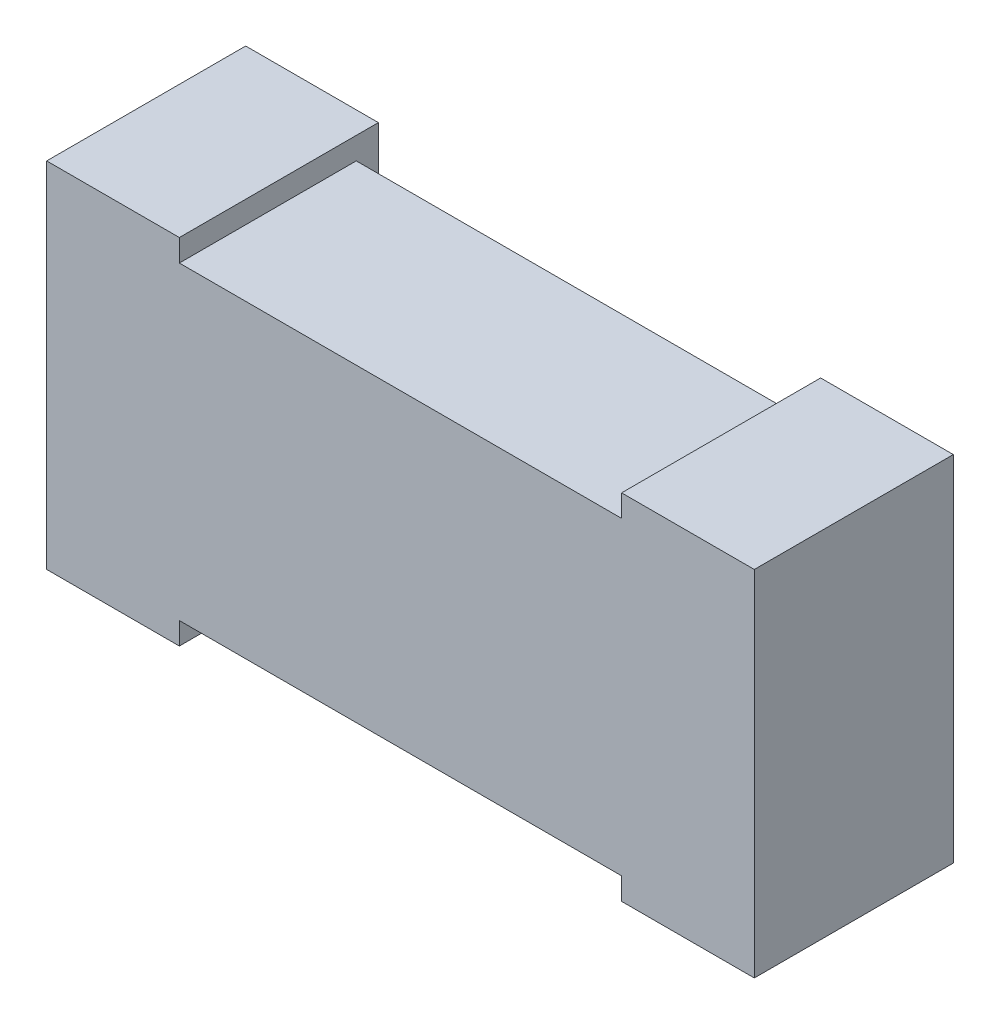
ISO-10303-21;
HEADER;
FILE_DESCRIPTION(('STEP AP214'),'2;1');
FILE_NAME('part.step','',(''),(''),'','','');
FILE_SCHEMA(('AUTOMOTIVE_DESIGN { 1 0 10303 214 1 1 1 1 }'));
ENDSEC;
DATA;
#1=APPLICATION_CONTEXT('core data for automotive mechanical design processes');
#2=APPLICATION_PROTOCOL_DEFINITION('international standard','automotive_design',2000,#1);
#3=PRODUCT_CONTEXT('',#1,'mechanical');
#4=PRODUCT('Part','Part','',(#3));
#5=PRODUCT_RELATED_PRODUCT_CATEGORY('part','',(#4));
#6=PRODUCT_DEFINITION_FORMATION('','',#4);
#7=PRODUCT_DEFINITION_CONTEXT('part definition',#1,'design');
#8=PRODUCT_DEFINITION('design','',#6,#7);
#9=PRODUCT_DEFINITION_SHAPE('','',#8);
#10=(LENGTH_UNIT() NAMED_UNIT(*) SI_UNIT(.MILLI.,.METRE.));
#11=(NAMED_UNIT(*) PLANE_ANGLE_UNIT() SI_UNIT($,.RADIAN.));
#12=(NAMED_UNIT(*) SI_UNIT($,.STERADIAN.) SOLID_ANGLE_UNIT());
#13=UNCERTAINTY_MEASURE_WITH_UNIT(LENGTH_MEASURE(1.E-05),#10,'distance_accuracy_value','');
#14=(GEOMETRIC_REPRESENTATION_CONTEXT(3) GLOBAL_UNCERTAINTY_ASSIGNED_CONTEXT((#13)) GLOBAL_UNIT_ASSIGNED_CONTEXT((#10,
#11,#12)) REPRESENTATION_CONTEXT('',''));
#15=CARTESIAN_POINT('',(0.,0.,0.));
#16=DIRECTION('',(0.,0.,1.));
#17=DIRECTION('',(1.,0.,0.));
#18=AXIS2_PLACEMENT_3D('',#15,#16,#17);
#19=CARTESIAN_POINT('',(1.999,1.799,-7.45));
#20=DIRECTION('',(0.,0.,-1.));
#21=DIRECTION('',(0.,1.,0.));
#22=AXIS2_PLACEMENT_3D('',#19,#20,#21);
#23=PLANE('',#22);
#24=DIRECTION('',(1.,0.,0.));
#25=VECTOR('',#24,1.);
#26=CARTESIAN_POINT('',(2.15,1.8,-7.45));
#27=LINE('',#26,#25);
#28=CARTESIAN_POINT('',(2.,1.8,-7.45));
#29=VERTEX_POINT('',#28);
#30=CARTESIAN_POINT('',(2.3,1.8,-7.45));
#31=VERTEX_POINT('',#30);
#32=EDGE_CURVE('E110',#29,#31,#27,.T.);
#33=ORIENTED_EDGE('',*,*,#32,.F.);
#34=DIRECTION('',(0.,-1.,0.));
#35=VECTOR('',#34,1.);
#36=CARTESIAN_POINT('',(2.,2.2,-7.45));
#37=LINE('',#36,#35);
#38=CARTESIAN_POINT('',(2.,2.6,-7.45));
#39=VERTEX_POINT('',#38);
#40=EDGE_CURVE('E104',#39,#29,#37,.T.);
#41=ORIENTED_EDGE('',*,*,#40,.F.);
#42=DIRECTION('',(-1.,0.,0.));
#43=VECTOR('',#42,1.);
#44=CARTESIAN_POINT('',(2.15,2.6,-7.45));
#45=LINE('',#44,#43);
#46=CARTESIAN_POINT('',(2.3,2.6,-7.45));
#47=VERTEX_POINT('',#46);
#48=EDGE_CURVE('E21',#47,#39,#45,.T.);
#49=ORIENTED_EDGE('',*,*,#48,.F.);
#50=DIRECTION('',(0.,1.,0.));
#51=VECTOR('',#50,1.);
#52=CARTESIAN_POINT('',(2.3,2.2,-7.45));
#53=LINE('',#52,#51);
#54=EDGE_CURVE('E131',#31,#47,#53,.T.);
#55=ORIENTED_EDGE('',*,*,#54,.F.);
#56=EDGE_LOOP('',(#33,#41,#49,#55));
#57=FACE_BOUND('',#56,.T.);
#58=ADVANCED_FACE('F17',(#57),#23,.T.);
#59=CARTESIAN_POINT('',(1.999,2.6,-6.999));
#60=DIRECTION('',(0.,1.,0.));
#61=DIRECTION('',(1.,0.,0.));
#62=AXIS2_PLACEMENT_3D('',#59,#60,#61);
#63=PLANE('',#62);
#64=DIRECTION('',(0.,0.,1.));
#65=VECTOR('',#64,1.);
#66=CARTESIAN_POINT('',(2.3,2.6,-7.225));
#67=LINE('',#66,#65);
#68=CARTESIAN_POINT('',(2.3,2.6,-7.));
#69=VERTEX_POINT('',#68);
#70=EDGE_CURVE('E117',#47,#69,#67,.T.);
#71=ORIENTED_EDGE('',*,*,#70,.F.);
#72=ORIENTED_EDGE('',*,*,#48,.T.);
#73=DIRECTION('',(0.,0.,-1.));
#74=VECTOR('',#73,1.);
#75=CARTESIAN_POINT('',(2.,2.6,-7.225));
#76=LINE('',#75,#74);
#77=CARTESIAN_POINT('',(2.,2.6,-7.));
#78=VERTEX_POINT('',#77);
#79=EDGE_CURVE('E112',#78,#39,#76,.T.);
#80=ORIENTED_EDGE('',*,*,#79,.F.);
#81=DIRECTION('',(-1.,0.,0.));
#82=VECTOR('',#81,1.);
#83=CARTESIAN_POINT('',(2.8,2.6,-7.));
#84=LINE('',#83,#82);
#85=EDGE_CURVE('E155',#69,#78,#84,.T.);
#86=ORIENTED_EDGE('',*,*,#85,.F.);
#87=EDGE_LOOP('',(#71,#72,#80,#86));
#88=FACE_BOUND('',#87,.T.);
#89=ADVANCED_FACE('F114',(#88),#63,.T.);
#90=CARTESIAN_POINT('',(2.,1.799,-6.999));
#91=DIRECTION('',(-1.,0.,0.));
#92=DIRECTION('',(0.,1.,0.));
#93=AXIS2_PLACEMENT_3D('',#90,#91,#92);
#94=PLANE('',#93);
#95=DIRECTION('',(0.,-1.,0.));
#96=VECTOR('',#95,1.);
#97=CARTESIAN_POINT('',(2.,2.2,-7.));
#98=LINE('',#97,#96);
#99=CARTESIAN_POINT('',(2.,1.8,-7.));
#100=VERTEX_POINT('',#99);
#101=EDGE_CURVE('E121',#78,#100,#98,.T.);
#102=ORIENTED_EDGE('',*,*,#101,.F.);
#103=ORIENTED_EDGE('',*,*,#79,.T.);
#104=ORIENTED_EDGE('',*,*,#40,.T.);
#105=DIRECTION('',(0.,0.,-1.));
#106=VECTOR('',#105,1.);
#107=CARTESIAN_POINT('',(2.,1.8,-7.225));
#108=LINE('',#107,#106);
#109=EDGE_CURVE('E123',#100,#29,#108,.T.);
#110=ORIENTED_EDGE('',*,*,#109,.F.);
#111=EDGE_LOOP('',(#102,#103,#104,#110));
#112=FACE_BOUND('',#111,.T.);
#113=ADVANCED_FACE('F119',(#112),#94,.T.);
#114=CARTESIAN_POINT('',(2.301,1.8,-6.999));
#115=DIRECTION('',(0.,-1.,0.));
#116=DIRECTION('',(-1.,0.,0.));
#117=AXIS2_PLACEMENT_3D('',#114,#115,#116);
#118=PLANE('',#117);
#119=ORIENTED_EDGE('',*,*,#109,.T.);
#120=ORIENTED_EDGE('',*,*,#32,.T.);
#121=DIRECTION('',(0.,0.,-1.));
#122=VECTOR('',#121,1.);
#123=CARTESIAN_POINT('',(2.3,1.8,-7.225));
#124=LINE('',#123,#122);
#125=CARTESIAN_POINT('',(2.3,1.8,-7.));
#126=VERTEX_POINT('',#125);
#127=EDGE_CURVE('E128',#126,#31,#124,.T.);
#128=ORIENTED_EDGE('',*,*,#127,.F.);
#129=DIRECTION('',(1.,0.,0.));
#130=VECTOR('',#129,1.);
#131=CARTESIAN_POINT('',(2.8,1.8,-7.));
#132=LINE('',#131,#130);
#133=EDGE_CURVE('E158',#100,#126,#132,.T.);
#134=ORIENTED_EDGE('',*,*,#133,.F.);
#135=EDGE_LOOP('',(#119,#120,#128,#134));
#136=FACE_BOUND('',#135,.T.);
#137=ADVANCED_FACE('F228',(#136),#118,.T.);
#138=CARTESIAN_POINT('',(2.3,2.601,-6.999));
#139=DIRECTION('',(1.,0.,0.));
#140=DIRECTION('',(0.,-1.,0.));
#141=AXIS2_PLACEMENT_3D('',#138,#139,#140);
#142=PLANE('',#141);
#143=ORIENTED_EDGE('',*,*,#70,.T.);
#144=DIRECTION('',(0.,1.,0.));
#145=VECTOR('',#144,1.);
#146=CARTESIAN_POINT('',(2.3,2.2,-7.));
#147=LINE('',#146,#145);
#148=CARTESIAN_POINT('',(2.3,2.55,-7.));
#149=VERTEX_POINT('',#148);
#150=EDGE_CURVE('E152',#149,#69,#147,.T.);
#151=ORIENTED_EDGE('',*,*,#150,.F.);
#152=DIRECTION('',(0.,0.,1.));
#153=VECTOR('',#152,1.);
#154=CARTESIAN_POINT('',(2.3,2.55,-7.2));
#155=LINE('',#154,#153);
#156=CARTESIAN_POINT('',(2.3,2.55,-7.4));
#157=VERTEX_POINT('',#156);
#158=EDGE_CURVE('E142',#157,#149,#155,.T.);
#159=ORIENTED_EDGE('',*,*,#158,.F.);
#160=DIRECTION('',(0.,1.,0.));
#161=VECTOR('',#160,1.);
#162=CARTESIAN_POINT('',(2.3,2.2,-7.4));
#163=LINE('',#162,#161);
#164=CARTESIAN_POINT('',(2.3,1.85,-7.4));
#165=VERTEX_POINT('',#164);
#166=EDGE_CURVE('E139',#165,#157,#163,.T.);
#167=ORIENTED_EDGE('',*,*,#166,.F.);
#168=DIRECTION('',(0.,0.,-1.));
#169=VECTOR('',#168,1.);
#170=CARTESIAN_POINT('',(2.3,1.85,-7.2));
#171=LINE('',#170,#169);
#172=CARTESIAN_POINT('',(2.3,1.85,-7.));
#173=VERTEX_POINT('',#172);
#174=EDGE_CURVE('E134',#173,#165,#171,.T.);
#175=ORIENTED_EDGE('',*,*,#174,.F.);
#176=DIRECTION('',(0.,1.,0.));
#177=VECTOR('',#176,1.);
#178=CARTESIAN_POINT('',(2.3,2.2,-7.));
#179=LINE('',#178,#177);
#180=EDGE_CURVE('E161',#126,#173,#179,.T.);
#181=ORIENTED_EDGE('',*,*,#180,.F.);
#182=ORIENTED_EDGE('',*,*,#127,.T.);
#183=ORIENTED_EDGE('',*,*,#54,.T.);
#184=EDGE_LOOP('',(#143,#151,#159,#167,#175,#181,#182,#183));
#185=FACE_BOUND('',#184,.T.);
#186=ADVANCED_FACE('F224',(#185),#142,.T.);
#187=CARTESIAN_POINT('',(3.301,1.85,-6.999));
#188=DIRECTION('',(0.,-1.,0.));
#189=DIRECTION('',(-1.,0.,0.));
#190=AXIS2_PLACEMENT_3D('',#187,#188,#189);
#191=PLANE('',#190);
#192=ORIENTED_EDGE('',*,*,#174,.T.);
#193=DIRECTION('',(-1.,0.,0.));
#194=VECTOR('',#193,1.);
#195=CARTESIAN_POINT('',(2.8,1.85,-7.4));
#196=LINE('',#195,#194);
#197=CARTESIAN_POINT('',(3.3,1.85,-7.4));
#198=VERTEX_POINT('',#197);
#199=EDGE_CURVE('E136',#198,#165,#196,.T.);
#200=ORIENTED_EDGE('',*,*,#199,.F.);
#201=DIRECTION('',(0.,0.,-1.));
#202=VECTOR('',#201,1.);
#203=CARTESIAN_POINT('',(3.3,1.85,-7.225));
#204=LINE('',#203,#202);
#205=CARTESIAN_POINT('',(3.3,1.85,-7.));
#206=VERTEX_POINT('',#205);
#207=EDGE_CURVE('E169',#206,#198,#204,.T.);
#208=ORIENTED_EDGE('',*,*,#207,.F.);
#209=DIRECTION('',(1.,0.,0.));
#210=VECTOR('',#209,1.);
#211=CARTESIAN_POINT('',(2.8,1.85,-7.));
#212=LINE('',#211,#210);
#213=EDGE_CURVE('E147',#173,#206,#212,.T.);
#214=ORIENTED_EDGE('',*,*,#213,.F.);
#215=EDGE_LOOP('',(#192,#200,#208,#214));
#216=FACE_BOUND('',#215,.T.);
#217=ADVANCED_FACE('F232',(#216),#191,.T.);
#218=CARTESIAN_POINT('',(2.299,1.849,-7.4));
#219=DIRECTION('',(0.,0.,-1.));
#220=DIRECTION('',(0.,1.,0.));
#221=AXIS2_PLACEMENT_3D('',#218,#219,#220);
#222=PLANE('',#221);
#223=ORIENTED_EDGE('',*,*,#199,.T.);
#224=ORIENTED_EDGE('',*,*,#166,.T.);
#225=DIRECTION('',(-1.,0.,0.));
#226=VECTOR('',#225,1.);
#227=CARTESIAN_POINT('',(2.8,2.55,-7.4));
#228=LINE('',#227,#226);
#229=CARTESIAN_POINT('',(3.3,2.55,-7.4));
#230=VERTEX_POINT('',#229);
#231=EDGE_CURVE('E144',#230,#157,#228,.T.);
#232=ORIENTED_EDGE('',*,*,#231,.F.);
#233=DIRECTION('',(0.,1.,0.));
#234=VECTOR('',#233,1.);
#235=CARTESIAN_POINT('',(3.3,2.2,-7.4));
#236=LINE('',#235,#234);
#237=EDGE_CURVE('E172',#198,#230,#236,.T.);
#238=ORIENTED_EDGE('',*,*,#237,.F.);
#239=EDGE_LOOP('',(#223,#224,#232,#238));
#240=FACE_BOUND('',#239,.T.);
#241=ADVANCED_FACE('F235',(#240),#222,.T.);
#242=CARTESIAN_POINT('',(2.299,2.55,-6.999));
#243=DIRECTION('',(0.,1.,0.));
#244=DIRECTION('',(1.,0.,0.));
#245=AXIS2_PLACEMENT_3D('',#242,#243,#244);
#246=PLANE('',#245);
#247=DIRECTION('',(0.,0.,1.));
#248=VECTOR('',#247,1.);
#249=CARTESIAN_POINT('',(3.3,2.55,-7.225));
#250=LINE('',#249,#248);
#251=CARTESIAN_POINT('',(3.3,2.55,-7.));
#252=VERTEX_POINT('',#251);
#253=EDGE_CURVE('E175',#230,#252,#250,.T.);
#254=ORIENTED_EDGE('',*,*,#253,.F.);
#255=ORIENTED_EDGE('',*,*,#231,.T.);
#256=ORIENTED_EDGE('',*,*,#158,.T.);
#257=DIRECTION('',(-1.,0.,0.));
#258=VECTOR('',#257,1.);
#259=CARTESIAN_POINT('',(2.8,2.55,-7.));
#260=LINE('',#259,#258);
#261=EDGE_CURVE('E149',#252,#149,#260,.T.);
#262=ORIENTED_EDGE('',*,*,#261,.F.);
#263=EDGE_LOOP('',(#254,#255,#256,#262));
#264=FACE_BOUND('',#263,.T.);
#265=ADVANCED_FACE('F221',(#264),#246,.T.);
#266=CARTESIAN_POINT('',(1.999,2.601,-7.));
#267=DIRECTION('',(0.,0.,1.));
#268=DIRECTION('',(0.,-1.,0.));
#269=AXIS2_PLACEMENT_3D('',#266,#267,#268);
#270=PLANE('',#269);
#271=ORIENTED_EDGE('',*,*,#133,.T.);
#272=ORIENTED_EDGE('',*,*,#180,.T.);
#273=ORIENTED_EDGE('',*,*,#213,.T.);
#274=DIRECTION('',(0.,1.,0.));
#275=VECTOR('',#274,1.);
#276=CARTESIAN_POINT('',(3.3,2.2,-7.));
#277=LINE('',#276,#275);
#278=CARTESIAN_POINT('',(3.3,1.8,-7.));
#279=VERTEX_POINT('',#278);
#280=EDGE_CURVE('E166',#279,#206,#277,.T.);
#281=ORIENTED_EDGE('',*,*,#280,.F.);
#282=DIRECTION('',(-1.,0.,0.));
#283=VECTOR('',#282,1.);
#284=CARTESIAN_POINT('',(3.45,1.8,-7.));
#285=LINE('',#284,#283);
#286=CARTESIAN_POINT('',(3.6,1.8,-7.));
#287=VERTEX_POINT('',#286);
#288=EDGE_CURVE('E192',#287,#279,#285,.T.);
#289=ORIENTED_EDGE('',*,*,#288,.F.);
#290=DIRECTION('',(0.,-1.,0.));
#291=VECTOR('',#290,1.);
#292=CARTESIAN_POINT('',(3.6,2.2,-7.));
#293=LINE('',#292,#291);
#294=CARTESIAN_POINT('',(3.6,2.6,-7.));
#295=VERTEX_POINT('',#294);
#296=EDGE_CURVE('E186',#295,#287,#293,.T.);
#297=ORIENTED_EDGE('',*,*,#296,.F.);
#298=DIRECTION('',(1.,0.,0.));
#299=VECTOR('',#298,1.);
#300=CARTESIAN_POINT('',(3.45,2.6,-7.));
#301=LINE('',#300,#299);
#302=CARTESIAN_POINT('',(3.3,2.6,-7.));
#303=VERTEX_POINT('',#302);
#304=EDGE_CURVE('E181',#303,#295,#301,.T.);
#305=ORIENTED_EDGE('',*,*,#304,.F.);
#306=DIRECTION('',(0.,1.,0.));
#307=VECTOR('',#306,1.);
#308=CARTESIAN_POINT('',(3.3,2.2,-7.));
#309=LINE('',#308,#307);
#310=EDGE_CURVE('E164',#252,#303,#309,.T.);
#311=ORIENTED_EDGE('',*,*,#310,.F.);
#312=ORIENTED_EDGE('',*,*,#261,.T.);
#313=ORIENTED_EDGE('',*,*,#150,.T.);
#314=ORIENTED_EDGE('',*,*,#85,.T.);
#315=ORIENTED_EDGE('',*,*,#101,.T.);
#316=EDGE_LOOP('',(#271,#272,#273,#281,#289,#297,#305,#311,#312,#313,#314,#315));
#317=FACE_BOUND('',#316,.T.);
#318=ADVANCED_FACE('F212',(#317),#270,.T.);
#319=CARTESIAN_POINT('',(3.3,1.799,-6.999));
#320=DIRECTION('',(-1.,0.,0.));
#321=DIRECTION('',(0.,1.,0.));
#322=AXIS2_PLACEMENT_3D('',#319,#320,#321);
#323=PLANE('',#322);
#324=ORIENTED_EDGE('',*,*,#237,.T.);
#325=ORIENTED_EDGE('',*,*,#253,.T.);
#326=ORIENTED_EDGE('',*,*,#310,.T.);
#327=DIRECTION('',(0.,0.,1.));
#328=VECTOR('',#327,1.);
#329=CARTESIAN_POINT('',(3.3,2.6,-7.225));
#330=LINE('',#329,#328);
#331=CARTESIAN_POINT('',(3.3,2.6,-7.45));
#332=VERTEX_POINT('',#331);
#333=EDGE_CURVE('E178',#332,#303,#330,.T.);
#334=ORIENTED_EDGE('',*,*,#333,.F.);
#335=DIRECTION('',(0.,1.,0.));
#336=VECTOR('',#335,1.);
#337=CARTESIAN_POINT('',(3.3,2.2,-7.45));
#338=LINE('',#337,#336);
#339=CARTESIAN_POINT('',(3.3,1.8,-7.45));
#340=VERTEX_POINT('',#339);
#341=EDGE_CURVE('E195',#340,#332,#338,.T.);
#342=ORIENTED_EDGE('',*,*,#341,.F.);
#343=DIRECTION('',(0.,0.,-1.));
#344=VECTOR('',#343,1.);
#345=CARTESIAN_POINT('',(3.3,1.8,-7.225));
#346=LINE('',#345,#344);
#347=EDGE_CURVE('E188',#279,#340,#346,.T.);
#348=ORIENTED_EDGE('',*,*,#347,.F.);
#349=ORIENTED_EDGE('',*,*,#280,.T.);
#350=ORIENTED_EDGE('',*,*,#207,.T.);
#351=EDGE_LOOP('',(#324,#325,#326,#334,#342,#348,#349,#350));
#352=FACE_BOUND('',#351,.T.);
#353=ADVANCED_FACE('F217',(#352),#323,.T.);
#354=CARTESIAN_POINT('',(3.299,2.6,-6.999));
#355=DIRECTION('',(0.,1.,0.));
#356=DIRECTION('',(1.,0.,0.));
#357=AXIS2_PLACEMENT_3D('',#354,#355,#356);
#358=PLANE('',#357);
#359=DIRECTION('',(0.,0.,1.));
#360=VECTOR('',#359,1.);
#361=CARTESIAN_POINT('',(3.6,2.6,-7.225));
#362=LINE('',#361,#360);
#363=CARTESIAN_POINT('',(3.6,2.6,-7.45));
#364=VERTEX_POINT('',#363);
#365=EDGE_CURVE('E183',#364,#295,#362,.T.);
#366=ORIENTED_EDGE('',*,*,#365,.F.);
#367=DIRECTION('',(1.,0.,0.));
#368=VECTOR('',#367,1.);
#369=CARTESIAN_POINT('',(3.45,2.6,-7.45));
#370=LINE('',#369,#368);
#371=EDGE_CURVE('E198',#332,#364,#370,.T.);
#372=ORIENTED_EDGE('',*,*,#371,.F.);
#373=ORIENTED_EDGE('',*,*,#333,.T.);
#374=ORIENTED_EDGE('',*,*,#304,.T.);
#375=EDGE_LOOP('',(#366,#372,#373,#374));
#376=FACE_BOUND('',#375,.T.);
#377=ADVANCED_FACE('F208',(#376),#358,.T.);
#378=CARTESIAN_POINT('',(3.6,2.601,-6.999));
#379=DIRECTION('',(1.,0.,0.));
#380=DIRECTION('',(0.,-1.,0.));
#381=AXIS2_PLACEMENT_3D('',#378,#379,#380);
#382=PLANE('',#381);
#383=DIRECTION('',(0.,0.,1.));
#384=VECTOR('',#383,1.);
#385=CARTESIAN_POINT('',(3.6,1.8,-7.225));
#386=LINE('',#385,#384);
#387=CARTESIAN_POINT('',(3.6,1.8,-7.45));
#388=VERTEX_POINT('',#387);
#389=EDGE_CURVE('E36',#388,#287,#386,.T.);
#390=ORIENTED_EDGE('',*,*,#389,.F.);
#391=DIRECTION('',(0.,-1.,0.));
#392=VECTOR('',#391,1.);
#393=CARTESIAN_POINT('',(3.6,2.2,-7.45));
#394=LINE('',#393,#392);
#395=EDGE_CURVE('E27',#364,#388,#394,.T.);
#396=ORIENTED_EDGE('',*,*,#395,.F.);
#397=ORIENTED_EDGE('',*,*,#365,.T.);
#398=ORIENTED_EDGE('',*,*,#296,.T.);
#399=EDGE_LOOP('',(#390,#396,#397,#398));
#400=FACE_BOUND('',#399,.T.);
#401=ADVANCED_FACE('F204',(#400),#382,.T.);
#402=CARTESIAN_POINT('',(3.601,1.8,-6.999));
#403=DIRECTION('',(0.,-1.,0.));
#404=DIRECTION('',(-1.,0.,0.));
#405=AXIS2_PLACEMENT_3D('',#402,#403,#404);
#406=PLANE('',#405);
#407=ORIENTED_EDGE('',*,*,#389,.T.);
#408=ORIENTED_EDGE('',*,*,#288,.T.);
#409=ORIENTED_EDGE('',*,*,#347,.T.);
#410=DIRECTION('',(-1.,0.,0.));
#411=VECTOR('',#410,1.);
#412=CARTESIAN_POINT('',(3.45,1.8,-7.45));
#413=LINE('',#412,#411);
#414=EDGE_CURVE('E11',#388,#340,#413,.T.);
#415=ORIENTED_EDGE('',*,*,#414,.F.);
#416=EDGE_LOOP('',(#407,#408,#409,#415));
#417=FACE_BOUND('',#416,.T.);
#418=ADVANCED_FACE('F215',(#417),#406,.T.);
#419=CARTESIAN_POINT('',(3.299,1.799,-7.45));
#420=DIRECTION('',(0.,0.,-1.));
#421=DIRECTION('',(0.,1.,0.));
#422=AXIS2_PLACEMENT_3D('',#419,#420,#421);
#423=PLANE('',#422);
#424=ORIENTED_EDGE('',*,*,#395,.T.);
#425=ORIENTED_EDGE('',*,*,#414,.T.);
#426=ORIENTED_EDGE('',*,*,#341,.T.);
#427=ORIENTED_EDGE('',*,*,#371,.T.);
#428=EDGE_LOOP('',(#424,#425,#426,#427));
#429=FACE_BOUND('',#428,.T.);
#430=ADVANCED_FACE('F19',(#429),#423,.T.);
#431=CLOSED_SHELL('',(#58,#89,#113,#137,#186,#217,#241,#265,#318,#353,#377,#401,#418,#430));
#432=MANIFOLD_SOLID_BREP('B1',#431);
#433=ADVANCED_BREP_SHAPE_REPRESENTATION('',(#18,#432),#14);
#434=SHAPE_DEFINITION_REPRESENTATION(#9,#433);
ENDSEC;
END-ISO-10303-21;
